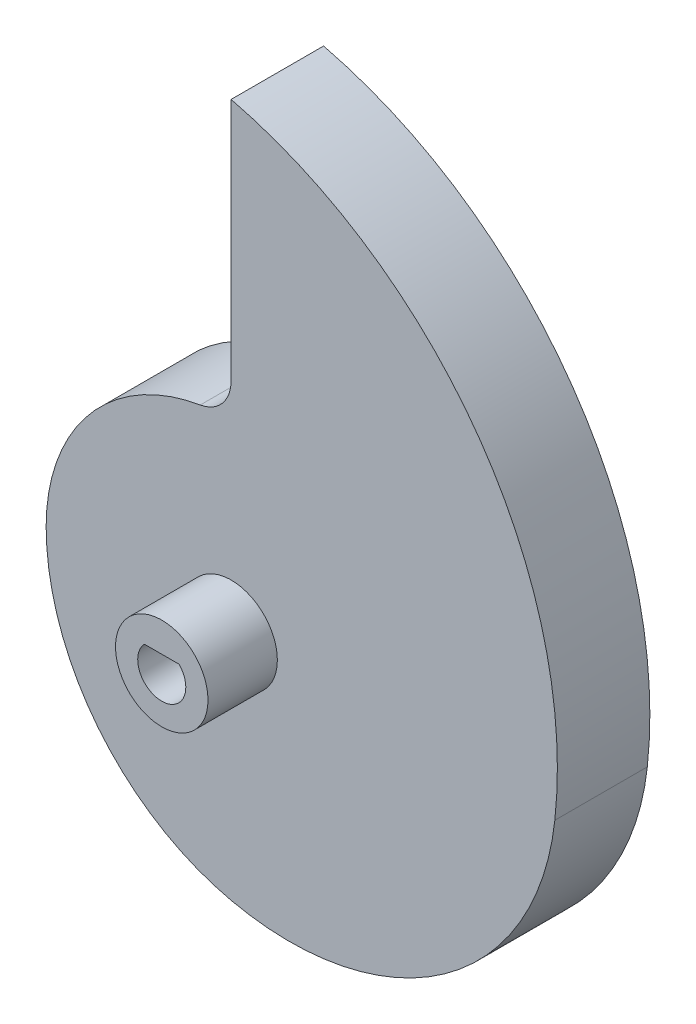
ISO-10303-21;
HEADER;
FILE_DESCRIPTION(('STEP AP214'),'2;1');
FILE_NAME('part.step','',(''),(''),'','','');
FILE_SCHEMA(('AUTOMOTIVE_DESIGN { 1 0 10303 214 1 1 1 1 }'));
ENDSEC;
DATA;
#1=APPLICATION_CONTEXT('core data for automotive mechanical design processes');
#2=APPLICATION_PROTOCOL_DEFINITION('international standard','automotive_design',2000,#1);
#3=PRODUCT_CONTEXT('',#1,'mechanical');
#4=PRODUCT('Part','Part','',(#3));
#5=PRODUCT_RELATED_PRODUCT_CATEGORY('part','',(#4));
#6=PRODUCT_DEFINITION_FORMATION('','',#4);
#7=PRODUCT_DEFINITION_CONTEXT('part definition',#1,'design');
#8=PRODUCT_DEFINITION('design','',#6,#7);
#9=PRODUCT_DEFINITION_SHAPE('','',#8);
#10=(LENGTH_UNIT() NAMED_UNIT(*) SI_UNIT(.MILLI.,.METRE.));
#11=(NAMED_UNIT(*) PLANE_ANGLE_UNIT() SI_UNIT($,.RADIAN.));
#12=(NAMED_UNIT(*) SI_UNIT($,.STERADIAN.) SOLID_ANGLE_UNIT());
#13=UNCERTAINTY_MEASURE_WITH_UNIT(LENGTH_MEASURE(1.E-05),#10,'distance_accuracy_value','');
#14=(GEOMETRIC_REPRESENTATION_CONTEXT(3) GLOBAL_UNCERTAINTY_ASSIGNED_CONTEXT((#13)) GLOBAL_UNIT_ASSIGNED_CONTEXT((#10,
#11,#12)) REPRESENTATION_CONTEXT('',''));
#15=CARTESIAN_POINT('',(0.,0.,0.));
#16=DIRECTION('',(0.,0.,1.));
#17=DIRECTION('',(1.,0.,0.));
#18=AXIS2_PLACEMENT_3D('',#15,#16,#17);
#19=CARTESIAN_POINT('',(0.,0.,0.));
#20=DIRECTION('',(0.,0.,1.));
#21=DIRECTION('',(1.,0.,0.));
#22=AXIS2_PLACEMENT_3D('',#19,#20,#21);
#23=PLANE('',#22);
#24=CARTESIAN_POINT('',(0.,0.,0.));
#25=DIRECTION('',(0.,0.,1.));
#26=DIRECTION('',(1.,0.,0.));
#27=AXIS2_PLACEMENT_3D('',#24,#25,#26);
#28=CIRCLE('',#27,12.7);
#29=CARTESIAN_POINT('',(-12.7,0.,0.));
#30=VERTEX_POINT('',#29);
#31=CARTESIAN_POINT('',(-2.11666666666667,12.5223688742275,0.));
#32=VERTEX_POINT('',#31);
#33=EDGE_CURVE('E141',#30,#32,#28,.F.);
#34=ORIENTED_EDGE('',*,*,#33,.T.);
#35=CARTESIAN_POINT('',(-2.54,15.026842649073,0.));
#36=DIRECTION('',(0.,0.,1.));
#37=DIRECTION('',(1.,0.,0.));
#38=AXIS2_PLACEMENT_3D('',#35,#36,#37);
#39=CIRCLE('',#38,2.54);
#40=CARTESIAN_POINT('',(0.,15.026842649073,0.));
#41=VERTEX_POINT('',#40);
#42=EDGE_CURVE('E41',#32,#41,#39,.T.);
#43=ORIENTED_EDGE('',*,*,#42,.T.);
#44=DIRECTION('',(0.,1.,0.));
#45=VECTOR('',#44,1.);
#46=CARTESIAN_POINT('',(0.,0.,0.));
#47=LINE('',#46,#45);
#48=CARTESIAN_POINT('',(0.,31.75,0.));
#49=VERTEX_POINT('',#48);
#50=EDGE_CURVE('E123',#41,#49,#47,.T.);
#51=ORIENTED_EDGE('',*,*,#50,.T.);
#52=CARTESIAN_POINT('',(-6.99821399311814,3.1975002048173,0.));
#53=DIRECTION('',(0.,0.,1.));
#54=DIRECTION('',(1.,0.,0.));
#55=AXIS2_PLACEMENT_3D('',#52,#53,#54);
#56=CIRCLE('',#55,29.3976230951991);
#57=CARTESIAN_POINT('',(22.225,0.,0.));
#58=VERTEX_POINT('',#57);
#59=EDGE_CURVE('E129',#58,#49,#56,.T.);
#60=ORIENTED_EDGE('',*,*,#59,.F.);
#61=CARTESIAN_POINT('',(4.02005703422054,1.99192015209125,0.));
#62=DIRECTION('',(0.,0.,1.));
#63=DIRECTION('',(1.,0.,0.));
#64=AXIS2_PLACEMENT_3D('',#61,#62,#63);
#65=CIRCLE('',#64,18.3135931558935);
#66=CARTESIAN_POINT('',(0.,-15.875,0.));
#67=VERTEX_POINT('',#66);
#68=EDGE_CURVE('E145',#67,#58,#65,.T.);
#69=ORIENTED_EDGE('',*,*,#68,.F.);
#70=CARTESIAN_POINT('',(3.571875,0.,0.));
#71=DIRECTION('',(0.,0.,1.));
#72=DIRECTION('',(1.,0.,0.));
#73=AXIS2_PLACEMENT_3D('',#70,#71,#72);
#74=CIRCLE('',#73,16.271875);
#75=EDGE_CURVE('E143',#30,#67,#74,.T.);
#76=ORIENTED_EDGE('',*,*,#75,.F.);
#77=EDGE_LOOP('',(#34,#43,#51,#60,#69,#76));
#78=FACE_BOUND('',#77,.T.);
#79=DIRECTION('',(1.,0.,0.));
#80=VECTOR('',#79,1.);
#81=CARTESIAN_POINT('',(0.,1.143,0.));
#82=LINE('',#81,#80);
#83=CARTESIAN_POINT('',(-1.19136560299515,1.143,0.));
#84=VERTEX_POINT('',#83);
#85=CARTESIAN_POINT('',(1.19136560299515,1.143,0.));
#86=VERTEX_POINT('',#85);
#87=EDGE_CURVE('E100',#84,#86,#82,.T.);
#88=ORIENTED_EDGE('',*,*,#87,.F.);
#89=CARTESIAN_POINT('',(0.,0.,0.));
#90=DIRECTION('',(0.,0.,1.));
#91=DIRECTION('',(1.,0.,0.));
#92=AXIS2_PLACEMENT_3D('',#89,#90,#91);
#93=CIRCLE('',#92,1.651);
#94=EDGE_CURVE('E108',#84,#86,#93,.T.);
#95=ORIENTED_EDGE('',*,*,#94,.T.);
#96=EDGE_LOOP('',(#88,#95));
#97=FACE_BOUND('',#96,.T.);
#98=ADVANCED_FACE('F33',(#78,#97),#23,.F.);
#99=CARTESIAN_POINT('',(0.,0.,11.1125));
#100=DIRECTION('',(0.,0.,1.));
#101=DIRECTION('',(1.,0.,0.));
#102=AXIS2_PLACEMENT_3D('',#99,#100,#101);
#103=PLANE('',#102);
#104=CARTESIAN_POINT('',(0.,0.,11.1125));
#105=DIRECTION('',(0.,0.,1.));
#106=DIRECTION('',(1.,0.,0.));
#107=AXIS2_PLACEMENT_3D('',#104,#105,#106);
#108=CIRCLE('',#107,3.175);
#109=CARTESIAN_POINT('',(3.175,0.,11.1125));
#110=VERTEX_POINT('',#109);
#111=EDGE_CURVE('E120',#110,#110,#108,.T.);
#112=ORIENTED_EDGE('',*,*,#111,.T.);
#113=EDGE_LOOP('',(#112));
#114=FACE_BOUND('',#113,.T.);
#115=CARTESIAN_POINT('',(0.,0.,11.1125));
#116=DIRECTION('',(0.,0.,1.));
#117=DIRECTION('',(1.,0.,0.));
#118=AXIS2_PLACEMENT_3D('',#115,#116,#117);
#119=CIRCLE('',#118,1.651);
#120=CARTESIAN_POINT('',(-1.19136560299515,1.143,11.1125));
#121=VERTEX_POINT('',#120);
#122=CARTESIAN_POINT('',(1.19136560299515,1.143,11.1125));
#123=VERTEX_POINT('',#122);
#124=EDGE_CURVE('E113',#121,#123,#119,.T.);
#125=ORIENTED_EDGE('',*,*,#124,.F.);
#126=DIRECTION('',(1.,0.,0.));
#127=VECTOR('',#126,1.);
#128=CARTESIAN_POINT('',(0.,1.143,11.1125));
#129=LINE('',#128,#127);
#130=EDGE_CURVE('E103',#121,#123,#129,.T.);
#131=ORIENTED_EDGE('',*,*,#130,.T.);
#132=EDGE_LOOP('',(#125,#131));
#133=FACE_BOUND('',#132,.T.);
#134=ADVANCED_FACE('F191',(#114,#133),#103,.T.);
#135=CARTESIAN_POINT('',(0.,0.,6.35));
#136=DIRECTION('',(0.,0.,1.));
#137=DIRECTION('',(1.,0.,0.));
#138=AXIS2_PLACEMENT_3D('',#135,#136,#137);
#139=PLANE('',#138);
#140=DIRECTION('',(0.,1.,0.));
#141=VECTOR('',#140,1.);
#142=CARTESIAN_POINT('',(0.,0.,6.35));
#143=LINE('',#142,#141);
#144=CARTESIAN_POINT('',(0.,15.026842649073,6.35));
#145=VERTEX_POINT('',#144);
#146=CARTESIAN_POINT('',(0.,31.75,6.35));
#147=VERTEX_POINT('',#146);
#148=EDGE_CURVE('E126',#145,#147,#143,.T.);
#149=ORIENTED_EDGE('',*,*,#148,.F.);
#150=CARTESIAN_POINT('',(-2.54,15.026842649073,6.35));
#151=DIRECTION('',(0.,0.,1.));
#152=DIRECTION('',(1.,0.,0.));
#153=AXIS2_PLACEMENT_3D('',#150,#151,#152);
#154=CIRCLE('',#153,2.54);
#155=CARTESIAN_POINT('',(-2.11666666666667,12.5223688742275,6.35));
#156=VERTEX_POINT('',#155);
#157=EDGE_CURVE('E11',#145,#156,#154,.F.);
#158=ORIENTED_EDGE('',*,*,#157,.T.);
#159=CARTESIAN_POINT('',(0.,0.,6.35));
#160=DIRECTION('',(0.,0.,1.));
#161=DIRECTION('',(1.,0.,0.));
#162=AXIS2_PLACEMENT_3D('',#159,#160,#161);
#163=CIRCLE('',#162,12.7);
#164=CARTESIAN_POINT('',(-12.7,0.,6.35));
#165=VERTEX_POINT('',#164);
#166=EDGE_CURVE('E128',#165,#156,#163,.F.);
#167=ORIENTED_EDGE('',*,*,#166,.F.);
#168=CARTESIAN_POINT('',(3.571875,0.,6.35));
#169=DIRECTION('',(0.,0.,1.));
#170=DIRECTION('',(1.,0.,0.));
#171=AXIS2_PLACEMENT_3D('',#168,#169,#170);
#172=CIRCLE('',#171,16.271875);
#173=CARTESIAN_POINT('',(0.,-15.875,6.35));
#174=VERTEX_POINT('',#173);
#175=EDGE_CURVE('E132',#165,#174,#172,.T.);
#176=ORIENTED_EDGE('',*,*,#175,.T.);
#177=CARTESIAN_POINT('',(4.02005703422054,1.99192015209125,6.35));
#178=DIRECTION('',(0.,0.,1.));
#179=DIRECTION('',(1.,0.,0.));
#180=AXIS2_PLACEMENT_3D('',#177,#178,#179);
#181=CIRCLE('',#180,18.3135931558935);
#182=CARTESIAN_POINT('',(22.225,0.,6.35));
#183=VERTEX_POINT('',#182);
#184=EDGE_CURVE('E134',#174,#183,#181,.T.);
#185=ORIENTED_EDGE('',*,*,#184,.T.);
#186=CARTESIAN_POINT('',(-6.99821399311814,3.1975002048173,6.35));
#187=DIRECTION('',(0.,0.,1.));
#188=DIRECTION('',(1.,0.,0.));
#189=AXIS2_PLACEMENT_3D('',#186,#187,#188);
#190=CIRCLE('',#189,29.3976230951991);
#191=EDGE_CURVE('E136',#183,#147,#190,.T.);
#192=ORIENTED_EDGE('',*,*,#191,.T.);
#193=EDGE_LOOP('',(#149,#158,#167,#176,#185,#192));
#194=FACE_BOUND('',#193,.T.);
#195=CARTESIAN_POINT('',(0.,0.,6.35));
#196=DIRECTION('',(0.,0.,1.));
#197=DIRECTION('',(1.,0.,0.));
#198=AXIS2_PLACEMENT_3D('',#195,#196,#197);
#199=CIRCLE('',#198,3.175);
#200=CARTESIAN_POINT('',(3.175,0.,6.35));
#201=VERTEX_POINT('',#200);
#202=EDGE_CURVE('E118',#201,#201,#199,.T.);
#203=ORIENTED_EDGE('',*,*,#202,.F.);
#204=EDGE_LOOP('',(#203));
#205=FACE_BOUND('',#204,.T.);
#206=ADVANCED_FACE('F182',(#194,#205),#139,.T.);
#207=CARTESIAN_POINT('',(0.,0.,6.35));
#208=DIRECTION('',(-1.,0.,0.));
#209=DIRECTION('',(0.,0.,1.));
#210=AXIS2_PLACEMENT_3D('',#207,#208,#209);
#211=PLANE('',#210);
#212=ORIENTED_EDGE('',*,*,#50,.F.);
#213=DIRECTION('',(0.,0.,1.));
#214=VECTOR('',#213,1.);
#215=CARTESIAN_POINT('',(0.,15.026842649073,6.35));
#216=LINE('',#215,#214);
#217=EDGE_CURVE('E48',#41,#145,#216,.T.);
#218=ORIENTED_EDGE('',*,*,#217,.T.);
#219=ORIENTED_EDGE('',*,*,#148,.T.);
#220=DIRECTION('',(0.,0.,-1.));
#221=VECTOR('',#220,1.);
#222=CARTESIAN_POINT('',(0.,31.75,6.35));
#223=LINE('',#222,#221);
#224=EDGE_CURVE('E139',#147,#49,#223,.T.);
#225=ORIENTED_EDGE('',*,*,#224,.T.);
#226=EDGE_LOOP('',(#212,#218,#219,#225));
#227=FACE_BOUND('',#226,.T.);
#228=ADVANCED_FACE('F213',(#227),#211,.T.);
#229=CARTESIAN_POINT('',(0.,0.,6.35));
#230=DIRECTION('',(0.,0.,-1.));
#231=DIRECTION('',(-1.,0.,0.));
#232=AXIS2_PLACEMENT_3D('',#229,#230,#231);
#233=CYLINDRICAL_SURFACE('',#232,12.7);
#234=ORIENTED_EDGE('',*,*,#166,.T.);
#235=DIRECTION('',(0.,0.,-1.));
#236=VECTOR('',#235,1.);
#237=CARTESIAN_POINT('',(-2.11666666666667,12.5223688742275,6.35));
#238=LINE('',#237,#236);
#239=EDGE_CURVE('E159',#156,#32,#238,.T.);
#240=ORIENTED_EDGE('',*,*,#239,.T.);
#241=ORIENTED_EDGE('',*,*,#33,.F.);
#242=DIRECTION('',(0.,0.,-1.));
#243=VECTOR('',#242,1.);
#244=CARTESIAN_POINT('',(-12.7,0.,6.35));
#245=LINE('',#244,#243);
#246=EDGE_CURVE('E157',#165,#30,#245,.T.);
#247=ORIENTED_EDGE('',*,*,#246,.F.);
#248=EDGE_LOOP('',(#234,#240,#241,#247));
#249=FACE_BOUND('',#248,.T.);
#250=ADVANCED_FACE('F165',(#249),#233,.T.);
#251=CARTESIAN_POINT('',(3.571875,0.,6.35));
#252=DIRECTION('',(0.,0.,-1.));
#253=DIRECTION('',(-1.,0.,0.));
#254=AXIS2_PLACEMENT_3D('',#251,#252,#253);
#255=CYLINDRICAL_SURFACE('',#254,16.271875);
#256=ORIENTED_EDGE('',*,*,#75,.T.);
#257=DIRECTION('',(0.,0.,-1.));
#258=VECTOR('',#257,1.);
#259=CARTESIAN_POINT('',(0.,-15.875,6.35));
#260=LINE('',#259,#258);
#261=EDGE_CURVE('E154',#174,#67,#260,.T.);
#262=ORIENTED_EDGE('',*,*,#261,.F.);
#263=ORIENTED_EDGE('',*,*,#175,.F.);
#264=ORIENTED_EDGE('',*,*,#246,.T.);
#265=EDGE_LOOP('',(#256,#262,#263,#264));
#266=FACE_BOUND('',#265,.T.);
#267=ADVANCED_FACE('F174',(#266),#255,.T.);
#268=CARTESIAN_POINT('',(4.02005703422054,1.99192015209125,6.35));
#269=DIRECTION('',(0.,0.,-1.));
#270=DIRECTION('',(-1.,0.,0.));
#271=AXIS2_PLACEMENT_3D('',#268,#269,#270);
#272=CYLINDRICAL_SURFACE('',#271,18.3135931558935);
#273=ORIENTED_EDGE('',*,*,#68,.T.);
#274=DIRECTION('',(0.,0.,-1.));
#275=VECTOR('',#274,1.);
#276=CARTESIAN_POINT('',(22.225,0.,6.35));
#277=LINE('',#276,#275);
#278=EDGE_CURVE('E151',#183,#58,#277,.T.);
#279=ORIENTED_EDGE('',*,*,#278,.F.);
#280=ORIENTED_EDGE('',*,*,#184,.F.);
#281=ORIENTED_EDGE('',*,*,#261,.T.);
#282=EDGE_LOOP('',(#273,#279,#280,#281));
#283=FACE_BOUND('',#282,.T.);
#284=ADVANCED_FACE('F178',(#283),#272,.T.);
#285=CARTESIAN_POINT('',(-6.99821399311814,3.1975002048173,6.35));
#286=DIRECTION('',(0.,0.,-1.));
#287=DIRECTION('',(-1.,0.,0.));
#288=AXIS2_PLACEMENT_3D('',#285,#286,#287);
#289=CYLINDRICAL_SURFACE('',#288,29.3976230951991);
#290=ORIENTED_EDGE('',*,*,#59,.T.);
#291=ORIENTED_EDGE('',*,*,#224,.F.);
#292=ORIENTED_EDGE('',*,*,#191,.F.);
#293=ORIENTED_EDGE('',*,*,#278,.T.);
#294=EDGE_LOOP('',(#290,#291,#292,#293));
#295=FACE_BOUND('',#294,.T.);
#296=ADVANCED_FACE('F203',(#295),#289,.T.);
#297=CARTESIAN_POINT('',(0.,0.,11.1125));
#298=DIRECTION('',(0.,0.,-1.));
#299=DIRECTION('',(-1.,0.,0.));
#300=AXIS2_PLACEMENT_3D('',#297,#298,#299);
#301=CYLINDRICAL_SURFACE('',#300,3.175);
#302=ORIENTED_EDGE('',*,*,#111,.F.);
#303=EDGE_LOOP('',(#302));
#304=FACE_BOUND('',#303,.T.);
#305=ORIENTED_EDGE('',*,*,#202,.T.);
#306=EDGE_LOOP('',(#305));
#307=FACE_BOUND('',#306,.T.);
#308=ADVANCED_FACE('F206',(#304,#307),#301,.T.);
#309=CARTESIAN_POINT('',(0.,1.143,0.));
#310=DIRECTION('',(0.,-1.,0.));
#311=DIRECTION('',(0.,0.,-1.));
#312=AXIS2_PLACEMENT_3D('',#309,#310,#311);
#313=PLANE('',#312);
#314=ORIENTED_EDGE('',*,*,#130,.F.);
#315=DIRECTION('',(0.,0.,1.));
#316=VECTOR('',#315,1.);
#317=CARTESIAN_POINT('',(-1.19136560299515,1.143,0.));
#318=LINE('',#317,#316);
#319=EDGE_CURVE('E96',#84,#121,#318,.T.);
#320=ORIENTED_EDGE('',*,*,#319,.F.);
#321=ORIENTED_EDGE('',*,*,#87,.T.);
#322=DIRECTION('',(0.,0.,1.));
#323=VECTOR('',#322,1.);
#324=CARTESIAN_POINT('',(1.19136560299515,1.143,0.));
#325=LINE('',#324,#323);
#326=EDGE_CURVE('E107',#86,#123,#325,.T.);
#327=ORIENTED_EDGE('',*,*,#326,.T.);
#328=EDGE_LOOP('',(#314,#320,#321,#327));
#329=FACE_BOUND('',#328,.T.);
#330=ADVANCED_FACE('F98',(#329),#313,.T.);
#331=CARTESIAN_POINT('',(0.,0.,0.));
#332=DIRECTION('',(0.,0.,1.));
#333=DIRECTION('',(1.,0.,0.));
#334=AXIS2_PLACEMENT_3D('',#331,#332,#333);
#335=CYLINDRICAL_SURFACE('',#334,1.651);
#336=ORIENTED_EDGE('',*,*,#124,.T.);
#337=ORIENTED_EDGE('',*,*,#326,.F.);
#338=ORIENTED_EDGE('',*,*,#94,.F.);
#339=ORIENTED_EDGE('',*,*,#319,.T.);
#340=EDGE_LOOP('',(#336,#337,#338,#339));
#341=FACE_BOUND('',#340,.T.);
#342=ADVANCED_FACE('F110',(#341),#335,.F.);
#343=CARTESIAN_POINT('',(-2.54,15.026842649073,6.35));
#344=DIRECTION('',(0.,0.,-1.));
#345=DIRECTION('',(-1.,0.,0.));
#346=AXIS2_PLACEMENT_3D('',#343,#344,#345);
#347=CYLINDRICAL_SURFACE('',#346,2.54);
#348=ORIENTED_EDGE('',*,*,#157,.F.);
#349=ORIENTED_EDGE('',*,*,#217,.F.);
#350=ORIENTED_EDGE('',*,*,#42,.F.);
#351=ORIENTED_EDGE('',*,*,#239,.F.);
#352=EDGE_LOOP('',(#348,#349,#350,#351));
#353=FACE_BOUND('',#352,.T.);
#354=ADVANCED_FACE('F35',(#353),#347,.F.);
#355=CLOSED_SHELL('',(#98,#134,#206,#228,#250,#267,#284,#296,#308,#330,#342,#354));
#356=MANIFOLD_SOLID_BREP('B2',#355);
#357=ADVANCED_BREP_SHAPE_REPRESENTATION('',(#18,#356),#14);
#358=SHAPE_DEFINITION_REPRESENTATION(#9,#357);
ENDSEC;
END-ISO-10303-21;
